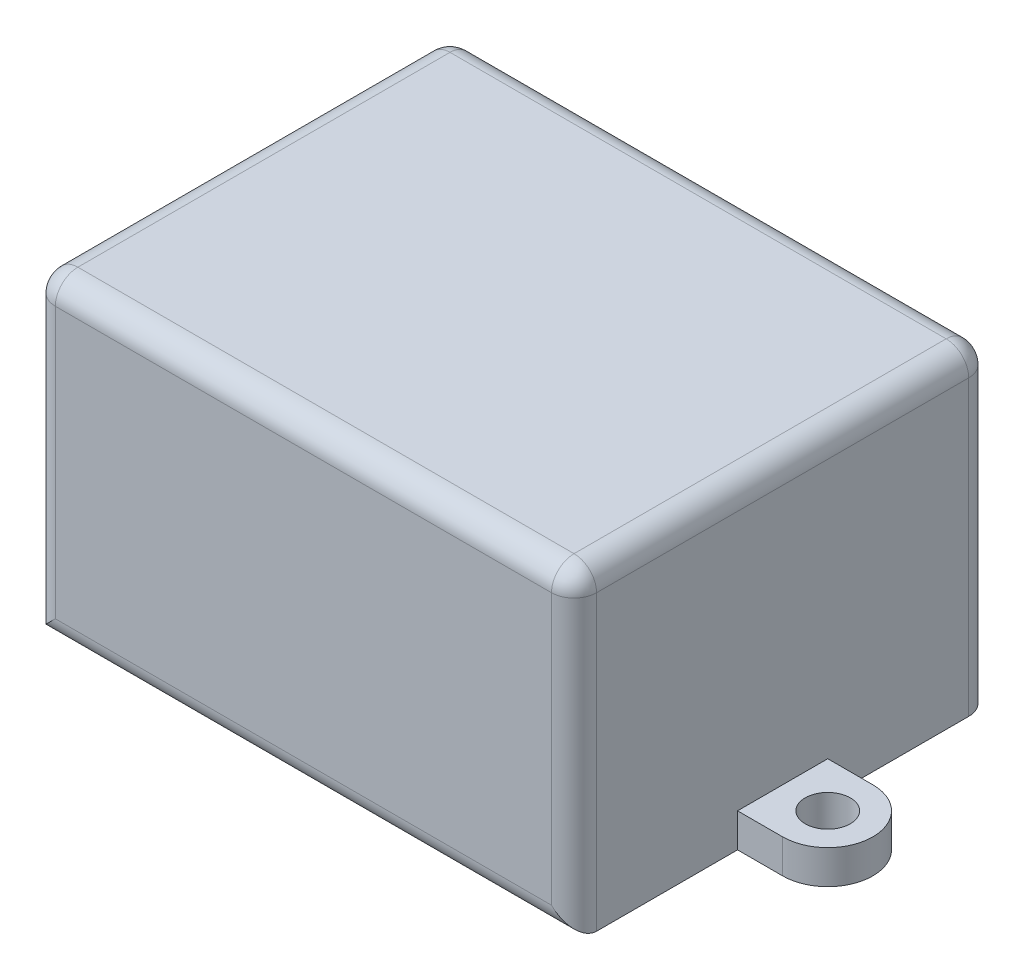
ISO-10303-21;
HEADER;
FILE_DESCRIPTION(('STEP AP214'),'2;1');
FILE_NAME('part.step','',(''),(''),'','','');
FILE_SCHEMA(('AUTOMOTIVE_DESIGN { 1 0 10303 214 1 1 1 1 }'));
ENDSEC;
DATA;
#1=APPLICATION_CONTEXT('core data for automotive mechanical design processes');
#2=APPLICATION_PROTOCOL_DEFINITION('international standard','automotive_design',2000,#1);
#3=PRODUCT_CONTEXT('',#1,'mechanical');
#4=PRODUCT('Part','Part','',(#3));
#5=PRODUCT_RELATED_PRODUCT_CATEGORY('part','',(#4));
#6=PRODUCT_DEFINITION_FORMATION('','',#4);
#7=PRODUCT_DEFINITION_CONTEXT('part definition',#1,'design');
#8=PRODUCT_DEFINITION('design','',#6,#7);
#9=PRODUCT_DEFINITION_SHAPE('','',#8);
#10=(LENGTH_UNIT() NAMED_UNIT(*) SI_UNIT(.MILLI.,.METRE.));
#11=(NAMED_UNIT(*) PLANE_ANGLE_UNIT() SI_UNIT($,.RADIAN.));
#12=(NAMED_UNIT(*) SI_UNIT($,.STERADIAN.) SOLID_ANGLE_UNIT());
#13=UNCERTAINTY_MEASURE_WITH_UNIT(LENGTH_MEASURE(1.E-05),#10,'distance_accuracy_value','');
#14=(GEOMETRIC_REPRESENTATION_CONTEXT(3) GLOBAL_UNCERTAINTY_ASSIGNED_CONTEXT((#13)) GLOBAL_UNIT_ASSIGNED_CONTEXT((#10,
#11,#12)) REPRESENTATION_CONTEXT('',''));
#15=CARTESIAN_POINT('',(0.,0.,0.));
#16=DIRECTION('',(0.,0.,1.));
#17=DIRECTION('',(1.,0.,0.));
#18=AXIS2_PLACEMENT_3D('',#15,#16,#17);
#19=CARTESIAN_POINT('',(0.,0.,37.));
#20=DIRECTION('',(1.,0.,0.));
#21=DIRECTION('',(0.,0.,-1.));
#22=AXIS2_PLACEMENT_3D('',#19,#20,#21);
#23=PLANE('',#22);
#24=DIRECTION('',(0.,0.,-1.));
#25=VECTOR('',#24,1.);
#26=CARTESIAN_POINT('',(0.,0.,37.));
#27=LINE('',#26,#25);
#28=CARTESIAN_POINT('',(0.,0.,14.5));
#29=VERTEX_POINT('',#28);
#30=CARTESIAN_POINT('',(0.,0.,2.));
#31=VERTEX_POINT('',#30);
#32=EDGE_CURVE('E240',#29,#31,#27,.T.);
#33=ORIENTED_EDGE('',*,*,#32,.F.);
#34=DIRECTION('',(0.,-1.,0.));
#35=VECTOR('',#34,1.);
#36=CARTESIAN_POINT('',(0.,3.,14.5));
#37=LINE('',#36,#35);
#38=CARTESIAN_POINT('',(0.,3.,14.5));
#39=VERTEX_POINT('',#38);
#40=EDGE_CURVE('E215',#39,#29,#37,.T.);
#41=ORIENTED_EDGE('',*,*,#40,.F.);
#42=DIRECTION('',(0.,0.,-1.));
#43=VECTOR('',#42,1.);
#44=CARTESIAN_POINT('',(0.,3.,0.));
#45=LINE('',#44,#43);
#46=CARTESIAN_POINT('',(0.,3.,22.5));
#47=VERTEX_POINT('',#46);
#48=EDGE_CURVE('E204',#47,#39,#45,.T.);
#49=ORIENTED_EDGE('',*,*,#48,.F.);
#50=DIRECTION('',(0.,-1.,0.));
#51=VECTOR('',#50,1.);
#52=CARTESIAN_POINT('',(0.,3.,22.5));
#53=LINE('',#52,#51);
#54=CARTESIAN_POINT('',(0.,0.,22.5));
#55=VERTEX_POINT('',#54);
#56=EDGE_CURVE('E229',#47,#55,#53,.T.);
#57=ORIENTED_EDGE('',*,*,#56,.T.);
#58=CARTESIAN_POINT('',(0.,0.,35.));
#59=VERTEX_POINT('',#58);
#60=EDGE_CURVE('E241',#59,#55,#27,.T.);
#61=ORIENTED_EDGE('',*,*,#60,.F.);
#62=DIRECTION('',(0.,-1.,0.));
#63=VECTOR('',#62,1.);
#64=CARTESIAN_POINT('',(0.,0.,35.));
#65=LINE('',#64,#63);
#66=CARTESIAN_POINT('',(0.,26.,35.));
#67=VERTEX_POINT('',#66);
#68=EDGE_CURVE('E272',#59,#67,#65,.F.);
#69=ORIENTED_EDGE('',*,*,#68,.T.);
#70=DIRECTION('',(0.,0.,-1.));
#71=VECTOR('',#70,1.);
#72=CARTESIAN_POINT('',(0.,26.,37.));
#73=LINE('',#72,#71);
#74=CARTESIAN_POINT('',(0.,26.,2.));
#75=VERTEX_POINT('',#74);
#76=EDGE_CURVE('E270',#67,#75,#73,.T.);
#77=ORIENTED_EDGE('',*,*,#76,.T.);
#78=DIRECTION('',(0.,-1.,0.));
#79=VECTOR('',#78,1.);
#80=CARTESIAN_POINT('',(0.,0.,2.));
#81=LINE('',#80,#79);
#82=EDGE_CURVE('E267',#75,#31,#81,.T.);
#83=ORIENTED_EDGE('',*,*,#82,.T.);
#84=EDGE_LOOP('',(#33,#41,#49,#57,#61,#69,#77,#83));
#85=FACE_BOUND('',#84,.T.);
#86=ADVANCED_FACE('F34',(#85),#23,.F.);
#87=CARTESIAN_POINT('',(0.,0.,37.));
#88=DIRECTION('',(0.,1.,0.));
#89=DIRECTION('',(0.,0.,1.));
#90=AXIS2_PLACEMENT_3D('',#87,#88,#89);
#91=PLANE('',#90);
#92=DIRECTION('',(0.,0.,-1.));
#93=VECTOR('',#92,1.);
#94=CARTESIAN_POINT('',(48.,0.,37.));
#95=LINE('',#94,#93);
#96=CARTESIAN_POINT('',(48.,0.,35.));
#97=VERTEX_POINT('',#96);
#98=CARTESIAN_POINT('',(48.,0.,22.5));
#99=VERTEX_POINT('',#98);
#100=EDGE_CURVE('E238',#97,#99,#95,.T.);
#101=ORIENTED_EDGE('',*,*,#100,.F.);
#102=DIRECTION('',(1.,0.,0.));
#103=VECTOR('',#102,1.);
#104=CARTESIAN_POINT('',(0.,0.,35.));
#105=LINE('',#104,#103);
#106=EDGE_CURVE('E265',#97,#59,#105,.F.);
#107=ORIENTED_EDGE('',*,*,#106,.T.);
#108=ORIENTED_EDGE('',*,*,#60,.T.);
#109=DIRECTION('',(1.,0.,0.));
#110=VECTOR('',#109,1.);
#111=CARTESIAN_POINT('',(0.,0.,22.5));
#112=LINE('',#111,#110);
#113=CARTESIAN_POINT('',(-4.,0.,22.5));
#114=VERTEX_POINT('',#113);
#115=EDGE_CURVE('E217',#114,#55,#112,.T.);
#116=ORIENTED_EDGE('',*,*,#115,.F.);
#117=CARTESIAN_POINT('',(-4.,0.,18.5));
#118=DIRECTION('',(0.,-1.,0.));
#119=DIRECTION('',(0.,0.,-1.));
#120=AXIS2_PLACEMENT_3D('',#117,#118,#119);
#121=CIRCLE('',#120,4.);
#122=CARTESIAN_POINT('',(-4.,0.,14.5));
#123=VERTEX_POINT('',#122);
#124=EDGE_CURVE('E219',#114,#123,#121,.T.);
#125=ORIENTED_EDGE('',*,*,#124,.T.);
#126=DIRECTION('',(1.,0.,0.));
#127=VECTOR('',#126,1.);
#128=CARTESIAN_POINT('',(0.,0.,14.5));
#129=LINE('',#128,#127);
#130=EDGE_CURVE('E198',#123,#29,#129,.T.);
#131=ORIENTED_EDGE('',*,*,#130,.T.);
#132=ORIENTED_EDGE('',*,*,#32,.T.);
#133=CARTESIAN_POINT('',(2.,0.,2.));
#134=DIRECTION('',(0.,1.,0.));
#135=DIRECTION('',(0.,0.,1.));
#136=AXIS2_PLACEMENT_3D('',#133,#134,#135);
#137=CIRCLE('',#136,2.);
#138=CARTESIAN_POINT('',(2.,0.,0.));
#139=VERTEX_POINT('',#138);
#140=EDGE_CURVE('E263',#31,#139,#137,.F.);
#141=ORIENTED_EDGE('',*,*,#140,.T.);
#142=DIRECTION('',(1.,0.,0.));
#143=VECTOR('',#142,1.);
#144=CARTESIAN_POINT('',(0.,0.,0.));
#145=LINE('',#144,#143);
#146=CARTESIAN_POINT('',(46.,0.,0.));
#147=VERTEX_POINT('',#146);
#148=EDGE_CURVE('E234',#139,#147,#145,.T.);
#149=ORIENTED_EDGE('',*,*,#148,.T.);
#150=CARTESIAN_POINT('',(46.,0.,2.));
#151=DIRECTION('',(0.,1.,0.));
#152=DIRECTION('',(0.,0.,1.));
#153=AXIS2_PLACEMENT_3D('',#150,#151,#152);
#154=CIRCLE('',#153,2.);
#155=CARTESIAN_POINT('',(48.,0.,2.));
#156=VERTEX_POINT('',#155);
#157=EDGE_CURVE('E260',#147,#156,#154,.F.);
#158=ORIENTED_EDGE('',*,*,#157,.T.);
#159=CARTESIAN_POINT('',(48.,0.,14.5));
#160=VERTEX_POINT('',#159);
#161=EDGE_CURVE('E237',#160,#156,#95,.T.);
#162=ORIENTED_EDGE('',*,*,#161,.F.);
#163=DIRECTION('',(1.,0.,0.));
#164=VECTOR('',#163,1.);
#165=CARTESIAN_POINT('',(0.,0.,14.5));
#166=LINE('',#165,#164);
#167=CARTESIAN_POINT('',(52.,0.,14.5));
#168=VERTEX_POINT('',#167);
#169=EDGE_CURVE('E192',#160,#168,#166,.T.);
#170=ORIENTED_EDGE('',*,*,#169,.T.);
#171=CARTESIAN_POINT('',(52.,0.,18.5));
#172=DIRECTION('',(0.,-1.,0.));
#173=DIRECTION('',(0.,0.,-1.));
#174=AXIS2_PLACEMENT_3D('',#171,#172,#173);
#175=CIRCLE('',#174,4.);
#176=CARTESIAN_POINT('',(52.,0.,22.5));
#177=VERTEX_POINT('',#176);
#178=EDGE_CURVE('E165',#168,#177,#175,.T.);
#179=ORIENTED_EDGE('',*,*,#178,.T.);
#180=DIRECTION('',(1.,0.,0.));
#181=VECTOR('',#180,1.);
#182=CARTESIAN_POINT('',(0.,0.,22.5));
#183=LINE('',#182,#181);
#184=EDGE_CURVE('E184',#99,#177,#183,.T.);
#185=ORIENTED_EDGE('',*,*,#184,.F.);
#186=EDGE_LOOP('',(#101,#107,#108,#116,#125,#131,#132,#141,#149,#158,#162,#170,#179,#185));
#187=FACE_BOUND('',#186,.T.);
#188=CARTESIAN_POINT('',(-4.,0.,18.5));
#189=DIRECTION('',(0.,-1.,0.));
#190=DIRECTION('',(0.,0.,-1.));
#191=AXIS2_PLACEMENT_3D('',#188,#189,#190);
#192=CIRCLE('',#191,2.);
#193=CARTESIAN_POINT('',(-4.,0.,16.5));
#194=VERTEX_POINT('',#193);
#195=EDGE_CURVE('E205',#194,#194,#192,.T.);
#196=ORIENTED_EDGE('',*,*,#195,.F.);
#197=EDGE_LOOP('',(#196));
#198=FACE_BOUND('',#197,.T.);
#199=CARTESIAN_POINT('',(52.,0.,18.5));
#200=DIRECTION('',(0.,-1.,0.));
#201=DIRECTION('',(0.,0.,-1.));
#202=AXIS2_PLACEMENT_3D('',#199,#200,#201);
#203=CIRCLE('',#202,2.);
#204=CARTESIAN_POINT('',(52.,0.,16.5));
#205=VERTEX_POINT('',#204);
#206=EDGE_CURVE('E189',#205,#205,#203,.T.);
#207=ORIENTED_EDGE('',*,*,#206,.F.);
#208=EDGE_LOOP('',(#207));
#209=FACE_BOUND('',#208,.T.);
#210=ADVANCED_FACE('F384',(#187,#198,#209),#91,.F.);
#211=CARTESIAN_POINT('',(48.,0.,37.));
#212=DIRECTION('',(-1.,0.,0.));
#213=DIRECTION('',(0.,0.,1.));
#214=AXIS2_PLACEMENT_3D('',#211,#212,#213);
#215=PLANE('',#214);
#216=DIRECTION('',(0.,0.,1.));
#217=VECTOR('',#216,1.);
#218=CARTESIAN_POINT('',(48.,3.,0.));
#219=LINE('',#218,#217);
#220=CARTESIAN_POINT('',(48.,3.,14.5));
#221=VERTEX_POINT('',#220);
#222=CARTESIAN_POINT('',(48.,3.,22.5));
#223=VERTEX_POINT('',#222);
#224=EDGE_CURVE('E56',#221,#223,#219,.T.);
#225=ORIENTED_EDGE('',*,*,#224,.F.);
#226=DIRECTION('',(0.,-1.,0.));
#227=VECTOR('',#226,1.);
#228=CARTESIAN_POINT('',(48.,3.,14.5));
#229=LINE('',#228,#227);
#230=EDGE_CURVE('E180',#221,#160,#229,.T.);
#231=ORIENTED_EDGE('',*,*,#230,.T.);
#232=ORIENTED_EDGE('',*,*,#161,.T.);
#233=DIRECTION('',(0.,1.,0.));
#234=VECTOR('',#233,1.);
#235=CARTESIAN_POINT('',(48.,28.,2.));
#236=LINE('',#235,#234);
#237=CARTESIAN_POINT('',(48.,26.,2.));
#238=VERTEX_POINT('',#237);
#239=EDGE_CURVE('E253',#156,#238,#236,.T.);
#240=ORIENTED_EDGE('',*,*,#239,.T.);
#241=DIRECTION('',(0.,0.,-1.));
#242=VECTOR('',#241,1.);
#243=CARTESIAN_POINT('',(48.,26.,37.));
#244=LINE('',#243,#242);
#245=CARTESIAN_POINT('',(48.,26.,35.));
#246=VERTEX_POINT('',#245);
#247=EDGE_CURVE('E255',#238,#246,#244,.F.);
#248=ORIENTED_EDGE('',*,*,#247,.T.);
#249=DIRECTION('',(0.,1.,0.));
#250=VECTOR('',#249,1.);
#251=CARTESIAN_POINT('',(48.,0.,35.));
#252=LINE('',#251,#250);
#253=EDGE_CURVE('E257',#246,#97,#252,.F.);
#254=ORIENTED_EDGE('',*,*,#253,.T.);
#255=ORIENTED_EDGE('',*,*,#100,.T.);
#256=DIRECTION('',(0.,-1.,0.));
#257=VECTOR('',#256,1.);
#258=CARTESIAN_POINT('',(48.,3.,22.5));
#259=LINE('',#258,#257);
#260=EDGE_CURVE('E51',#223,#99,#259,.T.);
#261=ORIENTED_EDGE('',*,*,#260,.F.);
#262=EDGE_LOOP('',(#225,#231,#232,#240,#248,#254,#255,#261));
#263=FACE_BOUND('',#262,.T.);
#264=ADVANCED_FACE('F419',(#263),#215,.F.);
#265=CARTESIAN_POINT('',(0.,28.,37.));
#266=DIRECTION('',(0.,-1.,0.));
#267=DIRECTION('',(0.,0.,-1.));
#268=AXIS2_PLACEMENT_3D('',#265,#266,#267);
#269=PLANE('',#268);
#270=DIRECTION('',(-1.,0.,0.));
#271=VECTOR('',#270,1.);
#272=CARTESIAN_POINT('',(0.,28.,35.));
#273=LINE('',#272,#271);
#274=CARTESIAN_POINT('',(2.,28.,35.));
#275=VERTEX_POINT('',#274);
#276=CARTESIAN_POINT('',(46.,28.,35.));
#277=VERTEX_POINT('',#276);
#278=EDGE_CURVE('E278',#275,#277,#273,.F.);
#279=ORIENTED_EDGE('',*,*,#278,.T.);
#280=DIRECTION('',(0.,0.,-1.));
#281=VECTOR('',#280,1.);
#282=CARTESIAN_POINT('',(46.,28.,37.));
#283=LINE('',#282,#281);
#284=CARTESIAN_POINT('',(46.,28.,2.));
#285=VERTEX_POINT('',#284);
#286=EDGE_CURVE('E280',#277,#285,#283,.T.);
#287=ORIENTED_EDGE('',*,*,#286,.T.);
#288=DIRECTION('',(-1.,0.,0.));
#289=VECTOR('',#288,1.);
#290=CARTESIAN_POINT('',(0.,28.,2.));
#291=LINE('',#290,#289);
#292=CARTESIAN_POINT('',(2.,28.,2.));
#293=VERTEX_POINT('',#292);
#294=EDGE_CURVE('E274',#285,#293,#291,.T.);
#295=ORIENTED_EDGE('',*,*,#294,.T.);
#296=DIRECTION('',(0.,0.,-1.));
#297=VECTOR('',#296,1.);
#298=CARTESIAN_POINT('',(2.,28.,37.));
#299=LINE('',#298,#297);
#300=EDGE_CURVE('E276',#293,#275,#299,.F.);
#301=ORIENTED_EDGE('',*,*,#300,.T.);
#302=EDGE_LOOP('',(#279,#287,#295,#301));
#303=FACE_BOUND('',#302,.T.);
#304=ADVANCED_FACE('F360',(#303),#269,.F.);
#305=CARTESIAN_POINT('',(0.,0.,37.));
#306=DIRECTION('',(0.,0.,-1.));
#307=DIRECTION('',(-1.,0.,0.));
#308=AXIS2_PLACEMENT_3D('',#305,#306,#307);
#309=PLANE('',#308);
#310=DIRECTION('',(1.,0.,0.));
#311=VECTOR('',#310,1.);
#312=CARTESIAN_POINT('',(0.,2.,37.));
#313=LINE('',#312,#311);
#314=CARTESIAN_POINT('',(2.,2.,37.));
#315=VERTEX_POINT('',#314);
#316=CARTESIAN_POINT('',(46.,2.,37.));
#317=VERTEX_POINT('',#316);
#318=EDGE_CURVE('E248',#315,#317,#313,.T.);
#319=ORIENTED_EDGE('',*,*,#318,.T.);
#320=DIRECTION('',(0.,1.,0.));
#321=VECTOR('',#320,1.);
#322=CARTESIAN_POINT('',(46.,0.,37.));
#323=LINE('',#322,#321);
#324=CARTESIAN_POINT('',(46.,26.,37.));
#325=VERTEX_POINT('',#324);
#326=EDGE_CURVE('E250',#317,#325,#323,.T.);
#327=ORIENTED_EDGE('',*,*,#326,.T.);
#328=DIRECTION('',(-1.,0.,0.));
#329=VECTOR('',#328,1.);
#330=CARTESIAN_POINT('',(0.,26.,37.));
#331=LINE('',#330,#329);
#332=CARTESIAN_POINT('',(2.,26.,37.));
#333=VERTEX_POINT('',#332);
#334=EDGE_CURVE('E244',#325,#333,#331,.T.);
#335=ORIENTED_EDGE('',*,*,#334,.T.);
#336=DIRECTION('',(0.,-1.,0.));
#337=VECTOR('',#336,1.);
#338=CARTESIAN_POINT('',(2.,0.,37.));
#339=LINE('',#338,#337);
#340=EDGE_CURVE('E246',#333,#315,#339,.T.);
#341=ORIENTED_EDGE('',*,*,#340,.T.);
#342=EDGE_LOOP('',(#319,#327,#335,#341));
#343=FACE_BOUND('',#342,.T.);
#344=ADVANCED_FACE('F351',(#343),#309,.F.);
#345=CARTESIAN_POINT('',(0.,0.,0.));
#346=DIRECTION('',(0.,0.,-1.));
#347=DIRECTION('',(-1.,0.,0.));
#348=AXIS2_PLACEMENT_3D('',#345,#346,#347);
#349=PLANE('',#348);
#350=ORIENTED_EDGE('',*,*,#148,.F.);
#351=DIRECTION('',(0.,-1.,0.));
#352=VECTOR('',#351,1.);
#353=CARTESIAN_POINT('',(2.,28.,0.));
#354=LINE('',#353,#352);
#355=CARTESIAN_POINT('',(2.,26.,0.));
#356=VERTEX_POINT('',#355);
#357=EDGE_CURVE('E11',#139,#356,#354,.F.);
#358=ORIENTED_EDGE('',*,*,#357,.T.);
#359=DIRECTION('',(-1.,0.,0.));
#360=VECTOR('',#359,1.);
#361=CARTESIAN_POINT('',(48.,26.,0.));
#362=LINE('',#361,#360);
#363=CARTESIAN_POINT('',(46.,26.,0.));
#364=VERTEX_POINT('',#363);
#365=EDGE_CURVE('E43',#356,#364,#362,.F.);
#366=ORIENTED_EDGE('',*,*,#365,.T.);
#367=DIRECTION('',(0.,1.,0.));
#368=VECTOR('',#367,1.);
#369=CARTESIAN_POINT('',(46.,0.,0.));
#370=LINE('',#369,#368);
#371=EDGE_CURVE('E283',#364,#147,#370,.F.);
#372=ORIENTED_EDGE('',*,*,#371,.T.);
#373=EDGE_LOOP('',(#350,#358,#366,#372));
#374=FACE_BOUND('',#373,.T.);
#375=ADVANCED_FACE('F377',(#374),#349,.T.);
#376=CARTESIAN_POINT('',(2.,0.,2.));
#377=DIRECTION('',(0.,1.,0.));
#378=DIRECTION('',(0.,0.,1.));
#379=AXIS2_PLACEMENT_3D('',#376,#377,#378);
#380=CYLINDRICAL_SURFACE('',#379,2.);
#381=CARTESIAN_POINT('',(2.,26.,2.));
#382=DIRECTION('',(0.,1.,0.));
#383=DIRECTION('',(0.,0.,1.));
#384=AXIS2_PLACEMENT_3D('',#381,#382,#383);
#385=CIRCLE('',#384,2.);
#386=EDGE_CURVE('E38',#356,#75,#385,.T.);
#387=ORIENTED_EDGE('',*,*,#386,.F.);
#388=ORIENTED_EDGE('',*,*,#357,.F.);
#389=ORIENTED_EDGE('',*,*,#140,.F.);
#390=ORIENTED_EDGE('',*,*,#82,.F.);
#391=EDGE_LOOP('',(#387,#388,#389,#390));
#392=FACE_BOUND('',#391,.T.);
#393=ADVANCED_FACE('F36',(#392),#380,.T.);
#394=CARTESIAN_POINT('',(2.,26.,2.));
#395=DIRECTION('',(-1.,0.,0.));
#396=DIRECTION('',(0.,0.,1.));
#397=AXIS2_PLACEMENT_3D('',#394,#395,#396);
#398=SPHERICAL_SURFACE('',#397,2.);
#399=CARTESIAN_POINT('',(2.,26.,2.));
#400=DIRECTION('',(-1.,0.,0.));
#401=DIRECTION('',(0.,0.,1.));
#402=AXIS2_PLACEMENT_3D('',#399,#400,#401);
#403=CIRCLE('',#402,2.);
#404=EDGE_CURVE('E315',#356,#293,#403,.F.);
#405=ORIENTED_EDGE('',*,*,#404,.F.);
#406=ORIENTED_EDGE('',*,*,#386,.T.);
#407=CARTESIAN_POINT('',(2.,26.,2.));
#408=DIRECTION('',(0.,0.,-1.));
#409=DIRECTION('',(-1.,0.,0.));
#410=AXIS2_PLACEMENT_3D('',#407,#408,#409);
#411=CIRCLE('',#410,2.);
#412=EDGE_CURVE('E317',#293,#75,#411,.F.);
#413=ORIENTED_EDGE('',*,*,#412,.F.);
#414=EDGE_LOOP('',(#405,#406,#413));
#415=FACE_BOUND('',#414,.T.);
#416=ADVANCED_FACE('F327',(#415),#398,.T.);
#417=CARTESIAN_POINT('',(2.,26.,37.));
#418=DIRECTION('',(0.,0.,-1.));
#419=DIRECTION('',(-1.,0.,0.));
#420=AXIS2_PLACEMENT_3D('',#417,#418,#419);
#421=CYLINDRICAL_SURFACE('',#420,2.);
#422=ORIENTED_EDGE('',*,*,#412,.T.);
#423=ORIENTED_EDGE('',*,*,#76,.F.);
#424=CARTESIAN_POINT('',(2.,26.,35.));
#425=DIRECTION('',(0.,0.,1.));
#426=DIRECTION('',(1.,0.,0.));
#427=AXIS2_PLACEMENT_3D('',#424,#425,#426);
#428=CIRCLE('',#427,2.);
#429=EDGE_CURVE('E312',#275,#67,#428,.T.);
#430=ORIENTED_EDGE('',*,*,#429,.F.);
#431=ORIENTED_EDGE('',*,*,#300,.F.);
#432=EDGE_LOOP('',(#422,#423,#430,#431));
#433=FACE_BOUND('',#432,.T.);
#434=ADVANCED_FACE('F339',(#433),#421,.T.);
#435=CARTESIAN_POINT('',(0.,26.,2.));
#436=DIRECTION('',(1.,0.,0.));
#437=DIRECTION('',(0.,0.,-1.));
#438=AXIS2_PLACEMENT_3D('',#435,#436,#437);
#439=CYLINDRICAL_SURFACE('',#438,2.);
#440=ORIENTED_EDGE('',*,*,#404,.T.);
#441=ORIENTED_EDGE('',*,*,#294,.F.);
#442=CARTESIAN_POINT('',(46.,26.,2.));
#443=DIRECTION('',(1.,0.,0.));
#444=DIRECTION('',(0.,0.,-1.));
#445=AXIS2_PLACEMENT_3D('',#442,#443,#444);
#446=CIRCLE('',#445,2.);
#447=EDGE_CURVE('E309',#364,#285,#446,.T.);
#448=ORIENTED_EDGE('',*,*,#447,.F.);
#449=ORIENTED_EDGE('',*,*,#365,.F.);
#450=EDGE_LOOP('',(#440,#441,#448,#449));
#451=FACE_BOUND('',#450,.T.);
#452=ADVANCED_FACE('F373',(#451),#439,.T.);
#453=CARTESIAN_POINT('',(46.,0.,2.));
#454=DIRECTION('',(0.,-1.,0.));
#455=DIRECTION('',(0.,0.,-1.));
#456=AXIS2_PLACEMENT_3D('',#453,#454,#455);
#457=CYLINDRICAL_SURFACE('',#456,2.);
#458=ORIENTED_EDGE('',*,*,#157,.F.);
#459=ORIENTED_EDGE('',*,*,#371,.F.);
#460=CARTESIAN_POINT('',(46.,26.,2.));
#461=DIRECTION('',(0.,1.,0.));
#462=DIRECTION('',(0.,0.,1.));
#463=AXIS2_PLACEMENT_3D('',#460,#461,#462);
#464=CIRCLE('',#463,2.);
#465=EDGE_CURVE('E306',#238,#364,#464,.T.);
#466=ORIENTED_EDGE('',*,*,#465,.F.);
#467=ORIENTED_EDGE('',*,*,#239,.F.);
#468=EDGE_LOOP('',(#458,#459,#466,#467));
#469=FACE_BOUND('',#468,.T.);
#470=ADVANCED_FACE('F380',(#469),#457,.T.);
#471=CARTESIAN_POINT('',(2.,26.,35.));
#472=DIRECTION('',(-1.,0.,0.));
#473=DIRECTION('',(0.,0.,1.));
#474=AXIS2_PLACEMENT_3D('',#471,#472,#473);
#475=SPHERICAL_SURFACE('',#474,2.);
#476=CARTESIAN_POINT('',(2.,26.,35.));
#477=DIRECTION('',(-1.,0.,0.));
#478=DIRECTION('',(0.,0.,1.));
#479=AXIS2_PLACEMENT_3D('',#476,#477,#478);
#480=CIRCLE('',#479,2.);
#481=EDGE_CURVE('E300',#275,#333,#480,.F.);
#482=ORIENTED_EDGE('',*,*,#481,.F.);
#483=ORIENTED_EDGE('',*,*,#429,.T.);
#484=CARTESIAN_POINT('',(2.,26.,35.));
#485=DIRECTION('',(0.,1.,0.));
#486=DIRECTION('',(0.,0.,1.));
#487=AXIS2_PLACEMENT_3D('',#484,#485,#486);
#488=CIRCLE('',#487,2.);
#489=EDGE_CURVE('E303',#333,#67,#488,.F.);
#490=ORIENTED_EDGE('',*,*,#489,.F.);
#491=EDGE_LOOP('',(#482,#483,#490));
#492=FACE_BOUND('',#491,.T.);
#493=ADVANCED_FACE('F343',(#492),#475,.T.);
#494=CARTESIAN_POINT('',(46.,26.,2.));
#495=DIRECTION('',(0.,0.,-1.));
#496=DIRECTION('',(-1.,0.,0.));
#497=AXIS2_PLACEMENT_3D('',#494,#495,#496);
#498=SPHERICAL_SURFACE('',#497,2.);
#499=ORIENTED_EDGE('',*,*,#465,.T.);
#500=ORIENTED_EDGE('',*,*,#447,.T.);
#501=CARTESIAN_POINT('',(46.,26.,2.));
#502=DIRECTION('',(0.,0.,-1.));
#503=DIRECTION('',(-1.,0.,0.));
#504=AXIS2_PLACEMENT_3D('',#501,#502,#503);
#505=CIRCLE('',#504,2.);
#506=EDGE_CURVE('E298',#238,#285,#505,.F.);
#507=ORIENTED_EDGE('',*,*,#506,.F.);
#508=EDGE_LOOP('',(#499,#500,#507));
#509=FACE_BOUND('',#508,.T.);
#510=ADVANCED_FACE('F370',(#509),#498,.T.);
#511=CARTESIAN_POINT('',(2.,0.,35.));
#512=DIRECTION('',(0.,-1.,0.));
#513=DIRECTION('',(0.,0.,-1.));
#514=AXIS2_PLACEMENT_3D('',#511,#512,#513);
#515=CYLINDRICAL_SURFACE('',#514,2.);
#516=ORIENTED_EDGE('',*,*,#489,.T.);
#517=ORIENTED_EDGE('',*,*,#68,.F.);
#518=CARTESIAN_POINT('',(2.,2.,35.));
#519=DIRECTION('',(0.707106781186547,-0.707106781186547,0.));
#520=DIRECTION('',(-0.707106781186547,-0.707106781186547,0.));
#521=AXIS2_PLACEMENT_3D('',#518,#519,#520);
#522=ELLIPSE('',#521,2.82842712474619,2.);
#523=EDGE_CURVE('E295',#315,#59,#522,.T.);
#524=ORIENTED_EDGE('',*,*,#523,.F.);
#525=ORIENTED_EDGE('',*,*,#340,.F.);
#526=EDGE_LOOP('',(#516,#517,#524,#525));
#527=FACE_BOUND('',#526,.T.);
#528=ADVANCED_FACE('F347',(#527),#515,.T.);
#529=CARTESIAN_POINT('',(0.,26.,35.));
#530=DIRECTION('',(-1.,0.,0.));
#531=DIRECTION('',(0.,0.,1.));
#532=AXIS2_PLACEMENT_3D('',#529,#530,#531);
#533=CYLINDRICAL_SURFACE('',#532,2.);
#534=ORIENTED_EDGE('',*,*,#481,.T.);
#535=ORIENTED_EDGE('',*,*,#334,.F.);
#536=CARTESIAN_POINT('',(46.,26.,35.));
#537=DIRECTION('',(1.,0.,0.));
#538=DIRECTION('',(0.,0.,-1.));
#539=AXIS2_PLACEMENT_3D('',#536,#537,#538);
#540=CIRCLE('',#539,2.);
#541=EDGE_CURVE('E292',#277,#325,#540,.T.);
#542=ORIENTED_EDGE('',*,*,#541,.F.);
#543=ORIENTED_EDGE('',*,*,#278,.F.);
#544=EDGE_LOOP('',(#534,#535,#542,#543));
#545=FACE_BOUND('',#544,.T.);
#546=ADVANCED_FACE('F357',(#545),#533,.T.);
#547=CARTESIAN_POINT('',(46.,26.,37.));
#548=DIRECTION('',(0.,0.,-1.));
#549=DIRECTION('',(-1.,0.,0.));
#550=AXIS2_PLACEMENT_3D('',#547,#548,#549);
#551=CYLINDRICAL_SURFACE('',#550,2.);
#552=ORIENTED_EDGE('',*,*,#506,.T.);
#553=ORIENTED_EDGE('',*,*,#286,.F.);
#554=CARTESIAN_POINT('',(46.,26.,35.));
#555=DIRECTION('',(0.,0.,1.));
#556=DIRECTION('',(1.,0.,0.));
#557=AXIS2_PLACEMENT_3D('',#554,#555,#556);
#558=CIRCLE('',#557,2.);
#559=EDGE_CURVE('E289',#246,#277,#558,.T.);
#560=ORIENTED_EDGE('',*,*,#559,.F.);
#561=ORIENTED_EDGE('',*,*,#247,.F.);
#562=EDGE_LOOP('',(#552,#553,#560,#561));
#563=FACE_BOUND('',#562,.T.);
#564=ADVANCED_FACE('F363',(#563),#551,.T.);
#565=CARTESIAN_POINT('',(0.,2.,35.));
#566=DIRECTION('',(1.,0.,0.));
#567=DIRECTION('',(0.,0.,-1.));
#568=AXIS2_PLACEMENT_3D('',#565,#566,#567);
#569=CYLINDRICAL_SURFACE('',#568,2.);
#570=ORIENTED_EDGE('',*,*,#523,.T.);
#571=ORIENTED_EDGE('',*,*,#106,.F.);
#572=CARTESIAN_POINT('',(46.,2.,35.));
#573=DIRECTION('',(0.707106781186547,0.707106781186547,0.));
#574=DIRECTION('',(0.707106781186547,-0.707106781186547,0.));
#575=AXIS2_PLACEMENT_3D('',#572,#573,#574);
#576=ELLIPSE('',#575,2.82842712474619,2.);
#577=EDGE_CURVE('E287',#317,#97,#576,.T.);
#578=ORIENTED_EDGE('',*,*,#577,.F.);
#579=ORIENTED_EDGE('',*,*,#318,.F.);
#580=EDGE_LOOP('',(#570,#571,#578,#579));
#581=FACE_BOUND('',#580,.T.);
#582=ADVANCED_FACE('F429',(#581),#569,.T.);
#583=CARTESIAN_POINT('',(46.,26.,35.));
#584=DIRECTION('',(0.,1.,0.));
#585=DIRECTION('',(0.,0.,1.));
#586=AXIS2_PLACEMENT_3D('',#583,#584,#585);
#587=SPHERICAL_SURFACE('',#586,2.);
#588=ORIENTED_EDGE('',*,*,#559,.T.);
#589=ORIENTED_EDGE('',*,*,#541,.T.);
#590=CARTESIAN_POINT('',(46.,26.,35.));
#591=DIRECTION('',(0.,1.,0.));
#592=DIRECTION('',(0.,0.,1.));
#593=AXIS2_PLACEMENT_3D('',#590,#591,#592);
#594=CIRCLE('',#593,2.);
#595=EDGE_CURVE('E226',#246,#325,#594,.F.);
#596=ORIENTED_EDGE('',*,*,#595,.F.);
#597=EDGE_LOOP('',(#588,#589,#596));
#598=FACE_BOUND('',#597,.T.);
#599=ADVANCED_FACE('F425',(#598),#587,.T.);
#600=CARTESIAN_POINT('',(46.,0.,35.));
#601=DIRECTION('',(0.,1.,0.));
#602=DIRECTION('',(0.,0.,1.));
#603=AXIS2_PLACEMENT_3D('',#600,#601,#602);
#604=CYLINDRICAL_SURFACE('',#603,2.);
#605=ORIENTED_EDGE('',*,*,#577,.T.);
#606=ORIENTED_EDGE('',*,*,#253,.F.);
#607=ORIENTED_EDGE('',*,*,#595,.T.);
#608=ORIENTED_EDGE('',*,*,#326,.F.);
#609=EDGE_LOOP('',(#605,#606,#607,#608));
#610=FACE_BOUND('',#609,.T.);
#611=ADVANCED_FACE('F411',(#610),#604,.T.);
#612=CARTESIAN_POINT('',(0.,3.,14.5));
#613=DIRECTION('',(0.,0.,-1.));
#614=DIRECTION('',(-1.,0.,0.));
#615=AXIS2_PLACEMENT_3D('',#612,#613,#614);
#616=PLANE('',#615);
#617=ORIENTED_EDGE('',*,*,#130,.F.);
#618=DIRECTION('',(0.,-1.,0.));
#619=VECTOR('',#618,1.);
#620=CARTESIAN_POINT('',(-4.,3.,14.5));
#621=LINE('',#620,#619);
#622=CARTESIAN_POINT('',(-4.,3.,14.5));
#623=VERTEX_POINT('',#622);
#624=EDGE_CURVE('E224',#623,#123,#621,.T.);
#625=ORIENTED_EDGE('',*,*,#624,.F.);
#626=DIRECTION('',(1.,0.,0.));
#627=VECTOR('',#626,1.);
#628=CARTESIAN_POINT('',(0.,3.,14.5));
#629=LINE('',#628,#627);
#630=EDGE_CURVE('E201',#623,#39,#629,.T.);
#631=ORIENTED_EDGE('',*,*,#630,.T.);
#632=ORIENTED_EDGE('',*,*,#40,.T.);
#633=EDGE_LOOP('',(#617,#625,#631,#632));
#634=FACE_BOUND('',#633,.T.);
#635=ADVANCED_FACE('F390',(#634),#616,.T.);
#636=CARTESIAN_POINT('',(-4.,3.,18.5));
#637=DIRECTION('',(0.,-1.,0.));
#638=DIRECTION('',(0.,0.,-1.));
#639=AXIS2_PLACEMENT_3D('',#636,#637,#638);
#640=CYLINDRICAL_SURFACE('',#639,4.);
#641=ORIENTED_EDGE('',*,*,#124,.F.);
#642=DIRECTION('',(0.,-1.,0.));
#643=VECTOR('',#642,1.);
#644=CARTESIAN_POINT('',(-4.,3.,22.5));
#645=LINE('',#644,#643);
#646=CARTESIAN_POINT('',(-4.,3.,22.5));
#647=VERTEX_POINT('',#646);
#648=EDGE_CURVE('E227',#647,#114,#645,.T.);
#649=ORIENTED_EDGE('',*,*,#648,.F.);
#650=CARTESIAN_POINT('',(-4.,3.,18.5));
#651=DIRECTION('',(0.,-1.,0.));
#652=DIRECTION('',(0.,0.,-1.));
#653=AXIS2_PLACEMENT_3D('',#650,#651,#652);
#654=CIRCLE('',#653,4.);
#655=EDGE_CURVE('E209',#647,#623,#654,.T.);
#656=ORIENTED_EDGE('',*,*,#655,.T.);
#657=ORIENTED_EDGE('',*,*,#624,.T.);
#658=EDGE_LOOP('',(#641,#649,#656,#657));
#659=FACE_BOUND('',#658,.T.);
#660=ADVANCED_FACE('F402',(#659),#640,.T.);
#661=CARTESIAN_POINT('',(0.,3.,22.5));
#662=DIRECTION('',(0.,0.,-1.));
#663=DIRECTION('',(-1.,0.,0.));
#664=AXIS2_PLACEMENT_3D('',#661,#662,#663);
#665=PLANE('',#664);
#666=ORIENTED_EDGE('',*,*,#115,.T.);
#667=ORIENTED_EDGE('',*,*,#56,.F.);
#668=DIRECTION('',(1.,0.,0.));
#669=VECTOR('',#668,1.);
#670=CARTESIAN_POINT('',(0.,3.,22.5));
#671=LINE('',#670,#669);
#672=EDGE_CURVE('E207',#647,#47,#671,.T.);
#673=ORIENTED_EDGE('',*,*,#672,.F.);
#674=ORIENTED_EDGE('',*,*,#648,.T.);
#675=EDGE_LOOP('',(#666,#667,#673,#674));
#676=FACE_BOUND('',#675,.T.);
#677=ADVANCED_FACE('F400',(#676),#665,.F.);
#678=CARTESIAN_POINT('',(-4.,3.,18.5));
#679=DIRECTION('',(0.,-1.,0.));
#680=DIRECTION('',(0.,0.,-1.));
#681=AXIS2_PLACEMENT_3D('',#678,#679,#680);
#682=CYLINDRICAL_SURFACE('',#681,2.);
#683=CARTESIAN_POINT('',(-4.,3.,18.5));
#684=DIRECTION('',(0.,-1.,0.));
#685=DIRECTION('',(0.,0.,-1.));
#686=AXIS2_PLACEMENT_3D('',#683,#684,#685);
#687=CIRCLE('',#686,2.);
#688=CARTESIAN_POINT('',(-4.,3.,16.5));
#689=VERTEX_POINT('',#688);
#690=EDGE_CURVE('E212',#689,#689,#687,.T.);
#691=ORIENTED_EDGE('',*,*,#690,.F.);
#692=EDGE_LOOP('',(#691));
#693=FACE_BOUND('',#692,.T.);
#694=ORIENTED_EDGE('',*,*,#195,.T.);
#695=EDGE_LOOP('',(#694));
#696=FACE_BOUND('',#695,.T.);
#697=ADVANCED_FACE('F409',(#693,#696),#682,.F.);
#698=CARTESIAN_POINT('',(0.,3.,0.));
#699=DIRECTION('',(0.,-1.,0.));
#700=DIRECTION('',(0.,0.,-1.));
#701=AXIS2_PLACEMENT_3D('',#698,#699,#700);
#702=PLANE('',#701);
#703=ORIENTED_EDGE('',*,*,#630,.F.);
#704=ORIENTED_EDGE('',*,*,#655,.F.);
#705=ORIENTED_EDGE('',*,*,#672,.T.);
#706=ORIENTED_EDGE('',*,*,#48,.T.);
#707=EDGE_LOOP('',(#703,#704,#705,#706));
#708=FACE_BOUND('',#707,.T.);
#709=ORIENTED_EDGE('',*,*,#690,.T.);
#710=EDGE_LOOP('',(#709));
#711=FACE_BOUND('',#710,.T.);
#712=ADVANCED_FACE('F395',(#708,#711),#702,.F.);
#713=CARTESIAN_POINT('',(0.,3.,14.5));
#714=DIRECTION('',(0.,0.,-1.));
#715=DIRECTION('',(-1.,0.,0.));
#716=AXIS2_PLACEMENT_3D('',#713,#714,#715);
#717=PLANE('',#716);
#718=ORIENTED_EDGE('',*,*,#169,.F.);
#719=ORIENTED_EDGE('',*,*,#230,.F.);
#720=DIRECTION('',(1.,0.,0.));
#721=VECTOR('',#720,1.);
#722=CARTESIAN_POINT('',(0.,3.,14.5));
#723=LINE('',#722,#721);
#724=CARTESIAN_POINT('',(52.,3.,14.5));
#725=VERTEX_POINT('',#724);
#726=EDGE_CURVE('E175',#221,#725,#723,.T.);
#727=ORIENTED_EDGE('',*,*,#726,.T.);
#728=DIRECTION('',(0.,-1.,0.));
#729=VECTOR('',#728,1.);
#730=CARTESIAN_POINT('',(52.,3.,14.5));
#731=LINE('',#730,#729);
#732=EDGE_CURVE('E160',#725,#168,#731,.T.);
#733=ORIENTED_EDGE('',*,*,#732,.T.);
#734=EDGE_LOOP('',(#718,#719,#727,#733));
#735=FACE_BOUND('',#734,.T.);
#736=ADVANCED_FACE('F179',(#735),#717,.T.);
#737=CARTESIAN_POINT('',(0.,3.,22.5));
#738=DIRECTION('',(0.,0.,-1.));
#739=DIRECTION('',(-1.,0.,0.));
#740=AXIS2_PLACEMENT_3D('',#737,#738,#739);
#741=PLANE('',#740);
#742=ORIENTED_EDGE('',*,*,#184,.T.);
#743=DIRECTION('',(0.,-1.,0.));
#744=VECTOR('',#743,1.);
#745=CARTESIAN_POINT('',(52.,3.,22.5));
#746=LINE('',#745,#744);
#747=CARTESIAN_POINT('',(52.,3.,22.5));
#748=VERTEX_POINT('',#747);
#749=EDGE_CURVE('E170',#748,#177,#746,.T.);
#750=ORIENTED_EDGE('',*,*,#749,.F.);
#751=DIRECTION('',(1.,0.,0.));
#752=VECTOR('',#751,1.);
#753=CARTESIAN_POINT('',(0.,3.,22.5));
#754=LINE('',#753,#752);
#755=EDGE_CURVE('E176',#223,#748,#754,.T.);
#756=ORIENTED_EDGE('',*,*,#755,.F.);
#757=ORIENTED_EDGE('',*,*,#260,.T.);
#758=EDGE_LOOP('',(#742,#750,#756,#757));
#759=FACE_BOUND('',#758,.T.);
#760=ADVANCED_FACE('F604',(#759),#741,.F.);
#761=CARTESIAN_POINT('',(52.,3.,18.5));
#762=DIRECTION('',(0.,-1.,0.));
#763=DIRECTION('',(0.,0.,-1.));
#764=AXIS2_PLACEMENT_3D('',#761,#762,#763);
#765=CYLINDRICAL_SURFACE('',#764,2.);
#766=CARTESIAN_POINT('',(52.,3.,18.5));
#767=DIRECTION('',(0.,-1.,0.));
#768=DIRECTION('',(0.,0.,-1.));
#769=AXIS2_PLACEMENT_3D('',#766,#767,#768);
#770=CIRCLE('',#769,2.);
#771=CARTESIAN_POINT('',(52.,3.,16.5));
#772=VERTEX_POINT('',#771);
#773=EDGE_CURVE('E181',#772,#772,#770,.T.);
#774=ORIENTED_EDGE('',*,*,#773,.F.);
#775=EDGE_LOOP('',(#774));
#776=FACE_BOUND('',#775,.T.);
#777=ORIENTED_EDGE('',*,*,#206,.T.);
#778=EDGE_LOOP('',(#777));
#779=FACE_BOUND('',#778,.T.);
#780=ADVANCED_FACE('F612',(#776,#779),#765,.F.);
#781=CARTESIAN_POINT('',(52.,3.,18.5));
#782=DIRECTION('',(0.,-1.,0.));
#783=DIRECTION('',(0.,0.,-1.));
#784=AXIS2_PLACEMENT_3D('',#781,#782,#783);
#785=CYLINDRICAL_SURFACE('',#784,4.);
#786=ORIENTED_EDGE('',*,*,#178,.F.);
#787=ORIENTED_EDGE('',*,*,#732,.F.);
#788=CARTESIAN_POINT('',(52.,3.,18.5));
#789=DIRECTION('',(0.,-1.,0.));
#790=DIRECTION('',(0.,0.,-1.));
#791=AXIS2_PLACEMENT_3D('',#788,#789,#790);
#792=CIRCLE('',#791,4.);
#793=EDGE_CURVE('E163',#725,#748,#792,.T.);
#794=ORIENTED_EDGE('',*,*,#793,.T.);
#795=ORIENTED_EDGE('',*,*,#749,.T.);
#796=EDGE_LOOP('',(#786,#787,#794,#795));
#797=FACE_BOUND('',#796,.T.);
#798=ADVANCED_FACE('F162',(#797),#785,.T.);
#799=CARTESIAN_POINT('',(0.,3.,0.));
#800=DIRECTION('',(0.,-1.,0.));
#801=DIRECTION('',(0.,0.,-1.));
#802=AXIS2_PLACEMENT_3D('',#799,#800,#801);
#803=PLANE('',#802);
#804=ORIENTED_EDGE('',*,*,#773,.T.);
#805=EDGE_LOOP('',(#804));
#806=FACE_BOUND('',#805,.T.);
#807=ORIENTED_EDGE('',*,*,#726,.F.);
#808=ORIENTED_EDGE('',*,*,#224,.T.);
#809=ORIENTED_EDGE('',*,*,#755,.T.);
#810=ORIENTED_EDGE('',*,*,#793,.F.);
#811=EDGE_LOOP('',(#807,#808,#809,#810));
#812=FACE_BOUND('',#811,.T.);
#813=ADVANCED_FACE('F174',(#806,#812),#803,.F.);
#814=CLOSED_SHELL('',(#86,#210,#264,#304,#344,#375,#393,#416,#434,#452,#470,#493,#510,#528,#546,
#564,#582,#599,#611,#635,#660,#677,#697,#712,#736,#760,#780,#798,#813));
#815=MANIFOLD_SOLID_BREP('B2',#814);
#816=ADVANCED_BREP_SHAPE_REPRESENTATION('',(#18,#815),#14);
#817=SHAPE_DEFINITION_REPRESENTATION(#9,#816);
ENDSEC;
END-ISO-10303-21;
